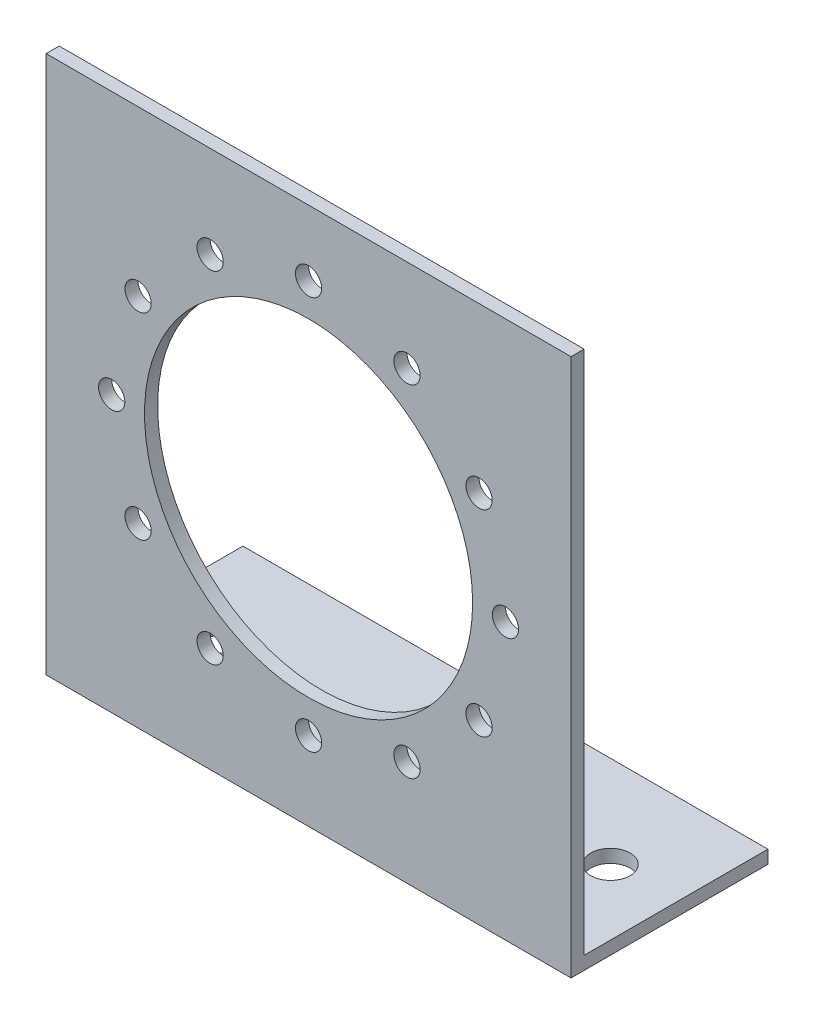
ISO-10303-21;
HEADER;
FILE_DESCRIPTION(('STEP AP214'),'2;1');
FILE_NAME('part.step','',(''),(''),'','','');
FILE_SCHEMA(('AUTOMOTIVE_DESIGN { 1 0 10303 214 1 1 1 1 }'));
ENDSEC;
DATA;
#1=APPLICATION_CONTEXT('core data for automotive mechanical design processes');
#2=APPLICATION_PROTOCOL_DEFINITION('international standard','automotive_design',2000,#1);
#3=PRODUCT_CONTEXT('',#1,'mechanical');
#4=PRODUCT('Part','Part','',(#3));
#5=PRODUCT_RELATED_PRODUCT_CATEGORY('part','',(#4));
#6=PRODUCT_DEFINITION_FORMATION('','',#4);
#7=PRODUCT_DEFINITION_CONTEXT('part definition',#1,'design');
#8=PRODUCT_DEFINITION('design','',#6,#7);
#9=PRODUCT_DEFINITION_SHAPE('','',#8);
#10=(LENGTH_UNIT() NAMED_UNIT(*) SI_UNIT(.MILLI.,.METRE.));
#11=(NAMED_UNIT(*) PLANE_ANGLE_UNIT() SI_UNIT($,.RADIAN.));
#12=(NAMED_UNIT(*) SI_UNIT($,.STERADIAN.) SOLID_ANGLE_UNIT());
#13=UNCERTAINTY_MEASURE_WITH_UNIT(LENGTH_MEASURE(1.E-05),#10,'distance_accuracy_value','');
#14=(GEOMETRIC_REPRESENTATION_CONTEXT(3) GLOBAL_UNCERTAINTY_ASSIGNED_CONTEXT((#13)) GLOBAL_UNIT_ASSIGNED_CONTEXT((#10,
#11,#12)) REPRESENTATION_CONTEXT('',''));
#15=CARTESIAN_POINT('',(0.,0.,0.));
#16=DIRECTION('',(0.,0.,1.));
#17=DIRECTION('',(1.,0.,0.));
#18=AXIS2_PLACEMENT_3D('',#15,#16,#17);
#19=CARTESIAN_POINT('',(0.,0.,1.));
#20=DIRECTION('',(0.,0.,-1.));
#21=DIRECTION('',(-1.,0.,0.));
#22=AXIS2_PLACEMENT_3D('',#19,#20,#21);
#23=PLANE('',#22);
#24=DIRECTION('',(0.,1.,0.));
#25=VECTOR('',#24,1.);
#26=CARTESIAN_POINT('',(20.,-20.,1.));
#27=LINE('',#26,#25);
#28=CARTESIAN_POINT('',(20.,-21.,1.));
#29=VERTEX_POINT('',#28);
#30=CARTESIAN_POINT('',(20.,20.,1.));
#31=VERTEX_POINT('',#30);
#32=EDGE_CURVE('E92',#29,#31,#27,.T.);
#33=ORIENTED_EDGE('',*,*,#32,.T.);
#34=DIRECTION('',(-1.,0.,0.));
#35=VECTOR('',#34,1.);
#36=CARTESIAN_POINT('',(-20.,20.,1.));
#37=LINE('',#36,#35);
#38=CARTESIAN_POINT('',(-20.,20.,1.));
#39=VERTEX_POINT('',#38);
#40=EDGE_CURVE('E54',#31,#39,#37,.T.);
#41=ORIENTED_EDGE('',*,*,#40,.T.);
#42=DIRECTION('',(0.,-1.,0.));
#43=VECTOR('',#42,1.);
#44=CARTESIAN_POINT('',(-20.,-20.,1.));
#45=LINE('',#44,#43);
#46=CARTESIAN_POINT('',(-20.,-21.,1.));
#47=VERTEX_POINT('',#46);
#48=EDGE_CURVE('E188',#39,#47,#45,.T.);
#49=ORIENTED_EDGE('',*,*,#48,.T.);
#50=DIRECTION('',(1.,0.,0.));
#51=VECTOR('',#50,1.);
#52=CARTESIAN_POINT('',(-20.,-21.,1.));
#53=LINE('',#52,#51);
#54=EDGE_CURVE('E209',#47,#29,#53,.T.);
#55=ORIENTED_EDGE('',*,*,#54,.T.);
#56=EDGE_LOOP('',(#33,#41,#49,#55));
#57=FACE_BOUND('',#56,.T.);
#58=CARTESIAN_POINT('',(0.,0.,1.));
#59=DIRECTION('',(0.,0.,1.));
#60=DIRECTION('',(1.,0.,0.));
#61=AXIS2_PLACEMENT_3D('',#58,#59,#60);
#62=CIRCLE('',#61,12.5);
#63=CARTESIAN_POINT('',(12.5,0.,1.));
#64=VERTEX_POINT('',#63);
#65=EDGE_CURVE('E181',#64,#64,#62,.T.);
#66=ORIENTED_EDGE('',*,*,#65,.F.);
#67=EDGE_LOOP('',(#66));
#68=FACE_BOUND('',#67,.T.);
#69=CARTESIAN_POINT('',(0.,15.,1.));
#70=DIRECTION('',(0.,0.,1.));
#71=DIRECTION('',(1.,0.,0.));
#72=AXIS2_PLACEMENT_3D('',#69,#70,#71);
#73=CIRCLE('',#72,1.);
#74=CARTESIAN_POINT('',(1.,15.,1.));
#75=VERTEX_POINT('',#74);
#76=EDGE_CURVE('E175',#75,#75,#73,.T.);
#77=ORIENTED_EDGE('',*,*,#76,.F.);
#78=EDGE_LOOP('',(#77));
#79=FACE_BOUND('',#78,.T.);
#80=CARTESIAN_POINT('',(7.50000000000011,12.990381056767,1.));
#81=DIRECTION('',(0.,0.,1.));
#82=DIRECTION('',(1.,0.,0.));
#83=AXIS2_PLACEMENT_3D('',#80,#81,#82);
#84=CIRCLE('',#83,1.);
#85=CARTESIAN_POINT('',(8.50000000000011,12.990381056767,1.));
#86=VERTEX_POINT('',#85);
#87=EDGE_CURVE('E169',#86,#86,#84,.T.);
#88=ORIENTED_EDGE('',*,*,#87,.F.);
#89=EDGE_LOOP('',(#88));
#90=FACE_BOUND('',#89,.T.);
#91=CARTESIAN_POINT('',(12.990381056767,7.50000000000065,1.));
#92=DIRECTION('',(0.,0.,1.));
#93=DIRECTION('',(1.,0.,0.));
#94=AXIS2_PLACEMENT_3D('',#91,#92,#93);
#95=CIRCLE('',#94,1.);
#96=CARTESIAN_POINT('',(13.990381056767,7.50000000000065,1.));
#97=VERTEX_POINT('',#96);
#98=EDGE_CURVE('E163',#97,#97,#95,.T.);
#99=ORIENTED_EDGE('',*,*,#98,.F.);
#100=EDGE_LOOP('',(#99));
#101=FACE_BOUND('',#100,.T.);
#102=CARTESIAN_POINT('',(15.0000000000007,7.43773659799704E-13,1.));
#103=DIRECTION('',(0.,0.,1.));
#104=DIRECTION('',(1.,0.,0.));
#105=AXIS2_PLACEMENT_3D('',#102,#103,#104);
#106=CIRCLE('',#105,1.);
#107=CARTESIAN_POINT('',(16.0000000000007,7.43773659799704E-13,1.));
#108=VERTEX_POINT('',#107);
#109=EDGE_CURVE('E157',#108,#108,#106,.T.);
#110=ORIENTED_EDGE('',*,*,#109,.F.);
#111=EDGE_LOOP('',(#110));
#112=FACE_BOUND('',#111,.T.);
#113=CARTESIAN_POINT('',(12.9903810567677,-7.49999999999936,1.));
#114=DIRECTION('',(0.,0.,1.));
#115=DIRECTION('',(1.,0.,0.));
#116=AXIS2_PLACEMENT_3D('',#113,#114,#115);
#117=CIRCLE('',#116,1.);
#118=CARTESIAN_POINT('',(13.9903810567677,-7.49999999999936,1.));
#119=VERTEX_POINT('',#118);
#120=EDGE_CURVE('E151',#119,#119,#117,.T.);
#121=ORIENTED_EDGE('',*,*,#120,.F.);
#122=EDGE_LOOP('',(#121));
#123=FACE_BOUND('',#122,.T.);
#124=CARTESIAN_POINT('',(7.50000000000139,-12.9903810567662,1.));
#125=DIRECTION('',(0.,0.,1.));
#126=DIRECTION('',(1.,0.,0.));
#127=AXIS2_PLACEMENT_3D('',#124,#125,#126);
#128=CIRCLE('',#127,0.999999999999999);
#129=CARTESIAN_POINT('',(8.50000000000139,-12.9903810567662,1.));
#130=VERTEX_POINT('',#129);
#131=EDGE_CURVE('E145',#130,#130,#128,.T.);
#132=ORIENTED_EDGE('',*,*,#131,.F.);
#133=EDGE_LOOP('',(#132));
#134=FACE_BOUND('',#133,.T.);
#135=CARTESIAN_POINT('',(1.48754731959941E-12,-15.,1.));
#136=DIRECTION('',(0.,0.,1.));
#137=DIRECTION('',(1.,0.,0.));
#138=AXIS2_PLACEMENT_3D('',#135,#136,#137);
#139=CIRCLE('',#138,1.);
#140=CARTESIAN_POINT('',(1.00000000000149,-15.,1.));
#141=VERTEX_POINT('',#140);
#142=EDGE_CURVE('E139',#141,#141,#139,.T.);
#143=ORIENTED_EDGE('',*,*,#142,.F.);
#144=EDGE_LOOP('',(#143));
#145=FACE_BOUND('',#144,.T.);
#146=CARTESIAN_POINT('',(-7.49999999999861,-12.990381056767,1.));
#147=DIRECTION('',(0.,0.,1.));
#148=DIRECTION('',(1.,0.,0.));
#149=AXIS2_PLACEMENT_3D('',#146,#147,#148);
#150=CIRCLE('',#149,1.);
#151=CARTESIAN_POINT('',(-6.49999999999861,-12.990381056767,1.));
#152=VERTEX_POINT('',#151);
#153=EDGE_CURVE('E133',#152,#152,#150,.T.);
#154=ORIENTED_EDGE('',*,*,#153,.F.);
#155=EDGE_LOOP('',(#154));
#156=FACE_BOUND('',#155,.T.);
#157=CARTESIAN_POINT('',(-12.9903810567655,-7.50000000000065,1.));
#158=DIRECTION('',(0.,0.,1.));
#159=DIRECTION('',(1.,0.,0.));
#160=AXIS2_PLACEMENT_3D('',#157,#158,#159);
#161=CIRCLE('',#160,1.);
#162=CARTESIAN_POINT('',(-11.9903810567655,-7.50000000000065,1.));
#163=VERTEX_POINT('',#162);
#164=EDGE_CURVE('E127',#163,#163,#161,.T.);
#165=ORIENTED_EDGE('',*,*,#164,.F.);
#166=EDGE_LOOP('',(#165));
#167=FACE_BOUND('',#166,.T.);
#168=CARTESIAN_POINT('',(-14.9999999999993,-7.45610629998425E-13,1.));
#169=DIRECTION('',(0.,0.,1.));
#170=DIRECTION('',(1.,0.,0.));
#171=AXIS2_PLACEMENT_3D('',#168,#169,#170);
#172=CIRCLE('',#171,1.);
#173=CARTESIAN_POINT('',(-13.9999999999993,-7.45610629998425E-13,1.));
#174=VERTEX_POINT('',#173);
#175=EDGE_CURVE('E121',#174,#174,#172,.T.);
#176=ORIENTED_EDGE('',*,*,#175,.F.);
#177=EDGE_LOOP('',(#176));
#178=FACE_BOUND('',#177,.T.);
#179=CARTESIAN_POINT('',(-12.9903810567662,7.49999999999935,1.));
#180=DIRECTION('',(0.,0.,1.));
#181=DIRECTION('',(1.,0.,0.));
#182=AXIS2_PLACEMENT_3D('',#179,#180,#181);
#183=CIRCLE('',#182,1.);
#184=CARTESIAN_POINT('',(-11.9903810567662,7.49999999999935,1.));
#185=VERTEX_POINT('',#184);
#186=EDGE_CURVE('E115',#185,#185,#183,.T.);
#187=ORIENTED_EDGE('',*,*,#186,.F.);
#188=EDGE_LOOP('',(#187));
#189=FACE_BOUND('',#188,.T.);
#190=CARTESIAN_POINT('',(-7.49999999999991,12.9903810567662,1.));
#191=DIRECTION('',(0.,0.,1.));
#192=DIRECTION('',(1.,0.,0.));
#193=AXIS2_PLACEMENT_3D('',#190,#191,#192);
#194=CIRCLE('',#193,1.);
#195=CARTESIAN_POINT('',(-6.49999999999991,12.9903810567662,1.));
#196=VERTEX_POINT('',#195);
#197=EDGE_CURVE('E108',#196,#196,#194,.T.);
#198=ORIENTED_EDGE('',*,*,#197,.F.);
#199=EDGE_LOOP('',(#198));
#200=FACE_BOUND('',#199,.T.);
#201=ADVANCED_FACE('F37',(#57,#68,#79,#90,#101,#112,#123,#134,#145,#156,#167,#178,#189,#200),
#23,.F.);
#202=CARTESIAN_POINT('',(0.,0.,0.));
#203=DIRECTION('',(0.,0.,-1.));
#204=DIRECTION('',(-1.,0.,0.));
#205=AXIS2_PLACEMENT_3D('',#202,#203,#204);
#206=PLANE('',#205);
#207=CARTESIAN_POINT('',(-12.9903810567662,7.49999999999935,0.));
#208=DIRECTION('',(0.,0.,1.));
#209=DIRECTION('',(1.,0.,0.));
#210=AXIS2_PLACEMENT_3D('',#207,#208,#209);
#211=CIRCLE('',#210,1.);
#212=CARTESIAN_POINT('',(-11.9903810567662,7.49999999999935,0.));
#213=VERTEX_POINT('',#212);
#214=EDGE_CURVE('E111',#213,#213,#211,.T.);
#215=ORIENTED_EDGE('',*,*,#214,.T.);
#216=EDGE_LOOP('',(#215));
#217=FACE_BOUND('',#216,.T.);
#218=CARTESIAN_POINT('',(-12.9903810567655,-7.50000000000065,0.));
#219=DIRECTION('',(0.,0.,1.));
#220=DIRECTION('',(1.,0.,0.));
#221=AXIS2_PLACEMENT_3D('',#218,#219,#220);
#222=CIRCLE('',#221,1.);
#223=CARTESIAN_POINT('',(-11.9903810567655,-7.50000000000065,0.));
#224=VERTEX_POINT('',#223);
#225=EDGE_CURVE('E124',#224,#224,#222,.T.);
#226=ORIENTED_EDGE('',*,*,#225,.T.);
#227=EDGE_LOOP('',(#226));
#228=FACE_BOUND('',#227,.T.);
#229=CARTESIAN_POINT('',(1.48754731959941E-12,-15.,0.));
#230=DIRECTION('',(0.,0.,1.));
#231=DIRECTION('',(1.,0.,0.));
#232=AXIS2_PLACEMENT_3D('',#229,#230,#231);
#233=CIRCLE('',#232,1.);
#234=CARTESIAN_POINT('',(1.00000000000149,-15.,0.));
#235=VERTEX_POINT('',#234);
#236=EDGE_CURVE('E136',#235,#235,#233,.T.);
#237=ORIENTED_EDGE('',*,*,#236,.T.);
#238=EDGE_LOOP('',(#237));
#239=FACE_BOUND('',#238,.T.);
#240=CARTESIAN_POINT('',(12.9903810567677,-7.49999999999936,0.));
#241=DIRECTION('',(0.,0.,1.));
#242=DIRECTION('',(1.,0.,0.));
#243=AXIS2_PLACEMENT_3D('',#240,#241,#242);
#244=CIRCLE('',#243,1.);
#245=CARTESIAN_POINT('',(13.9903810567677,-7.49999999999936,0.));
#246=VERTEX_POINT('',#245);
#247=EDGE_CURVE('E148',#246,#246,#244,.T.);
#248=ORIENTED_EDGE('',*,*,#247,.T.);
#249=EDGE_LOOP('',(#248));
#250=FACE_BOUND('',#249,.T.);
#251=CARTESIAN_POINT('',(12.990381056767,7.50000000000065,0.));
#252=DIRECTION('',(0.,0.,1.));
#253=DIRECTION('',(1.,0.,0.));
#254=AXIS2_PLACEMENT_3D('',#251,#252,#253);
#255=CIRCLE('',#254,1.);
#256=CARTESIAN_POINT('',(13.990381056767,7.50000000000065,0.));
#257=VERTEX_POINT('',#256);
#258=EDGE_CURVE('E160',#257,#257,#255,.T.);
#259=ORIENTED_EDGE('',*,*,#258,.T.);
#260=EDGE_LOOP('',(#259));
#261=FACE_BOUND('',#260,.T.);
#262=CARTESIAN_POINT('',(0.,15.,0.));
#263=DIRECTION('',(0.,0.,1.));
#264=DIRECTION('',(1.,0.,0.));
#265=AXIS2_PLACEMENT_3D('',#262,#263,#264);
#266=CIRCLE('',#265,1.);
#267=CARTESIAN_POINT('',(1.,15.,0.));
#268=VERTEX_POINT('',#267);
#269=EDGE_CURVE('E172',#268,#268,#266,.T.);
#270=ORIENTED_EDGE('',*,*,#269,.T.);
#271=EDGE_LOOP('',(#270));
#272=FACE_BOUND('',#271,.T.);
#273=DIRECTION('',(0.,1.,0.));
#274=VECTOR('',#273,1.);
#275=CARTESIAN_POINT('',(20.,-20.,0.));
#276=LINE('',#275,#274);
#277=CARTESIAN_POINT('',(20.,-20.,0.));
#278=VERTEX_POINT('',#277);
#279=CARTESIAN_POINT('',(20.,20.,0.));
#280=VERTEX_POINT('',#279);
#281=EDGE_CURVE('E88',#278,#280,#276,.T.);
#282=ORIENTED_EDGE('',*,*,#281,.F.);
#283=DIRECTION('',(1.,0.,0.));
#284=VECTOR('',#283,1.);
#285=CARTESIAN_POINT('',(-20.,-20.,0.));
#286=LINE('',#285,#284);
#287=CARTESIAN_POINT('',(-20.,-20.,0.));
#288=VERTEX_POINT('',#287);
#289=EDGE_CURVE('E81',#288,#278,#286,.T.);
#290=ORIENTED_EDGE('',*,*,#289,.F.);
#291=DIRECTION('',(0.,-1.,0.));
#292=VECTOR('',#291,1.);
#293=CARTESIAN_POINT('',(-20.,-20.,0.));
#294=LINE('',#293,#292);
#295=CARTESIAN_POINT('',(-20.,20.,0.));
#296=VERTEX_POINT('',#295);
#297=EDGE_CURVE('E71',#296,#288,#294,.T.);
#298=ORIENTED_EDGE('',*,*,#297,.F.);
#299=DIRECTION('',(-1.,0.,0.));
#300=VECTOR('',#299,1.);
#301=CARTESIAN_POINT('',(-20.,20.,0.));
#302=LINE('',#301,#300);
#303=EDGE_CURVE('E65',#280,#296,#302,.T.);
#304=ORIENTED_EDGE('',*,*,#303,.F.);
#305=EDGE_LOOP('',(#282,#290,#298,#304));
#306=FACE_BOUND('',#305,.T.);
#307=CARTESIAN_POINT('',(0.,0.,0.));
#308=DIRECTION('',(0.,0.,1.));
#309=DIRECTION('',(1.,0.,0.));
#310=AXIS2_PLACEMENT_3D('',#307,#308,#309);
#311=CIRCLE('',#310,12.5);
#312=CARTESIAN_POINT('',(12.5,0.,0.));
#313=VERTEX_POINT('',#312);
#314=EDGE_CURVE('E178',#313,#313,#311,.T.);
#315=ORIENTED_EDGE('',*,*,#314,.T.);
#316=EDGE_LOOP('',(#315));
#317=FACE_BOUND('',#316,.T.);
#318=CARTESIAN_POINT('',(7.50000000000011,12.990381056767,0.));
#319=DIRECTION('',(0.,0.,1.));
#320=DIRECTION('',(1.,0.,0.));
#321=AXIS2_PLACEMENT_3D('',#318,#319,#320);
#322=CIRCLE('',#321,1.);
#323=CARTESIAN_POINT('',(8.50000000000011,12.990381056767,0.));
#324=VERTEX_POINT('',#323);
#325=EDGE_CURVE('E166',#324,#324,#322,.T.);
#326=ORIENTED_EDGE('',*,*,#325,.T.);
#327=EDGE_LOOP('',(#326));
#328=FACE_BOUND('',#327,.T.);
#329=CARTESIAN_POINT('',(15.0000000000007,7.43773659799704E-13,0.));
#330=DIRECTION('',(0.,0.,1.));
#331=DIRECTION('',(1.,0.,0.));
#332=AXIS2_PLACEMENT_3D('',#329,#330,#331);
#333=CIRCLE('',#332,1.);
#334=CARTESIAN_POINT('',(16.0000000000007,7.43773659799704E-13,0.));
#335=VERTEX_POINT('',#334);
#336=EDGE_CURVE('E154',#335,#335,#333,.T.);
#337=ORIENTED_EDGE('',*,*,#336,.T.);
#338=EDGE_LOOP('',(#337));
#339=FACE_BOUND('',#338,.T.);
#340=CARTESIAN_POINT('',(7.50000000000139,-12.9903810567662,0.));
#341=DIRECTION('',(0.,0.,1.));
#342=DIRECTION('',(1.,0.,0.));
#343=AXIS2_PLACEMENT_3D('',#340,#341,#342);
#344=CIRCLE('',#343,0.999999999999999);
#345=CARTESIAN_POINT('',(8.50000000000139,-12.9903810567662,0.));
#346=VERTEX_POINT('',#345);
#347=EDGE_CURVE('E142',#346,#346,#344,.T.);
#348=ORIENTED_EDGE('',*,*,#347,.T.);
#349=EDGE_LOOP('',(#348));
#350=FACE_BOUND('',#349,.T.);
#351=CARTESIAN_POINT('',(-7.49999999999861,-12.990381056767,0.));
#352=DIRECTION('',(0.,0.,1.));
#353=DIRECTION('',(1.,0.,0.));
#354=AXIS2_PLACEMENT_3D('',#351,#352,#353);
#355=CIRCLE('',#354,1.);
#356=CARTESIAN_POINT('',(-6.49999999999861,-12.990381056767,0.));
#357=VERTEX_POINT('',#356);
#358=EDGE_CURVE('E130',#357,#357,#355,.T.);
#359=ORIENTED_EDGE('',*,*,#358,.T.);
#360=EDGE_LOOP('',(#359));
#361=FACE_BOUND('',#360,.T.);
#362=CARTESIAN_POINT('',(-14.9999999999993,-7.45610629998425E-13,0.));
#363=DIRECTION('',(0.,0.,1.));
#364=DIRECTION('',(1.,0.,0.));
#365=AXIS2_PLACEMENT_3D('',#362,#363,#364);
#366=CIRCLE('',#365,1.);
#367=CARTESIAN_POINT('',(-13.9999999999993,-7.45610629998425E-13,0.));
#368=VERTEX_POINT('',#367);
#369=EDGE_CURVE('E118',#368,#368,#366,.T.);
#370=ORIENTED_EDGE('',*,*,#369,.T.);
#371=EDGE_LOOP('',(#370));
#372=FACE_BOUND('',#371,.T.);
#373=CARTESIAN_POINT('',(-7.49999999999991,12.9903810567662,0.));
#374=DIRECTION('',(0.,0.,1.));
#375=DIRECTION('',(1.,0.,0.));
#376=AXIS2_PLACEMENT_3D('',#373,#374,#375);
#377=CIRCLE('',#376,1.);
#378=CARTESIAN_POINT('',(-6.49999999999991,12.9903810567662,0.));
#379=VERTEX_POINT('',#378);
#380=EDGE_CURVE('E112',#379,#379,#377,.T.);
#381=ORIENTED_EDGE('',*,*,#380,.T.);
#382=EDGE_LOOP('',(#381));
#383=FACE_BOUND('',#382,.T.);
#384=ADVANCED_FACE('F85',(#217,#228,#239,#250,#261,#272,#306,#317,#328,#339,#350,#361,#372,
#383),#206,.T.);
#385=CARTESIAN_POINT('',(20.,-20.,1.));
#386=DIRECTION('',(-1.,0.,0.));
#387=DIRECTION('',(0.,0.,1.));
#388=AXIS2_PLACEMENT_3D('',#385,#386,#387);
#389=PLANE('',#388);
#390=ORIENTED_EDGE('',*,*,#281,.T.);
#391=DIRECTION('',(0.,0.,-1.));
#392=VECTOR('',#391,1.);
#393=CARTESIAN_POINT('',(20.,20.,1.));
#394=LINE('',#393,#392);
#395=EDGE_CURVE('E11',#31,#280,#394,.T.);
#396=ORIENTED_EDGE('',*,*,#395,.F.);
#397=ORIENTED_EDGE('',*,*,#32,.F.);
#398=DIRECTION('',(0.,0.,1.));
#399=VECTOR('',#398,1.);
#400=CARTESIAN_POINT('',(20.,-21.,-14.));
#401=LINE('',#400,#399);
#402=CARTESIAN_POINT('',(20.,-21.,-14.));
#403=VERTEX_POINT('',#402);
#404=EDGE_CURVE('E102',#403,#29,#401,.T.);
#405=ORIENTED_EDGE('',*,*,#404,.F.);
#406=DIRECTION('',(0.,1.,0.));
#407=VECTOR('',#406,1.);
#408=CARTESIAN_POINT('',(20.,-20.,-14.));
#409=LINE('',#408,#407);
#410=CARTESIAN_POINT('',(20.,-20.,-14.));
#411=VERTEX_POINT('',#410);
#412=EDGE_CURVE('E198',#403,#411,#409,.T.);
#413=ORIENTED_EDGE('',*,*,#412,.T.);
#414=DIRECTION('',(0.,0.,1.));
#415=VECTOR('',#414,1.);
#416=CARTESIAN_POINT('',(20.,-20.,-14.));
#417=LINE('',#416,#415);
#418=EDGE_CURVE('E99',#411,#278,#417,.T.);
#419=ORIENTED_EDGE('',*,*,#418,.T.);
#420=EDGE_LOOP('',(#390,#396,#397,#405,#413,#419));
#421=FACE_BOUND('',#420,.T.);
#422=ADVANCED_FACE('F39',(#421),#389,.F.);
#423=CARTESIAN_POINT('',(-20.,20.,1.));
#424=DIRECTION('',(0.,-1.,0.));
#425=DIRECTION('',(0.,0.,-1.));
#426=AXIS2_PLACEMENT_3D('',#423,#424,#425);
#427=PLANE('',#426);
#428=ORIENTED_EDGE('',*,*,#303,.T.);
#429=DIRECTION('',(0.,0.,-1.));
#430=VECTOR('',#429,1.);
#431=CARTESIAN_POINT('',(-20.,20.,1.));
#432=LINE('',#431,#430);
#433=EDGE_CURVE('E46',#39,#296,#432,.T.);
#434=ORIENTED_EDGE('',*,*,#433,.F.);
#435=ORIENTED_EDGE('',*,*,#40,.F.);
#436=ORIENTED_EDGE('',*,*,#395,.T.);
#437=EDGE_LOOP('',(#428,#434,#435,#436));
#438=FACE_BOUND('',#437,.T.);
#439=ADVANCED_FACE('F270',(#438),#427,.F.);
#440=CARTESIAN_POINT('',(-20.,-20.,1.));
#441=DIRECTION('',(1.,0.,0.));
#442=DIRECTION('',(0.,0.,-1.));
#443=AXIS2_PLACEMENT_3D('',#440,#441,#442);
#444=PLANE('',#443);
#445=ORIENTED_EDGE('',*,*,#297,.T.);
#446=DIRECTION('',(0.,0.,1.));
#447=VECTOR('',#446,1.);
#448=CARTESIAN_POINT('',(-20.,-20.,-14.));
#449=LINE('',#448,#447);
#450=CARTESIAN_POINT('',(-20.,-20.,-14.));
#451=VERTEX_POINT('',#450);
#452=EDGE_CURVE('E77',#451,#288,#449,.T.);
#453=ORIENTED_EDGE('',*,*,#452,.F.);
#454=DIRECTION('',(0.,-1.,0.));
#455=VECTOR('',#454,1.);
#456=CARTESIAN_POINT('',(-20.,-20.,-14.));
#457=LINE('',#456,#455);
#458=CARTESIAN_POINT('',(-20.,-21.,-14.));
#459=VERTEX_POINT('',#458);
#460=EDGE_CURVE('E206',#451,#459,#457,.T.);
#461=ORIENTED_EDGE('',*,*,#460,.T.);
#462=DIRECTION('',(0.,0.,1.));
#463=VECTOR('',#462,1.);
#464=CARTESIAN_POINT('',(-20.,-21.,-14.));
#465=LINE('',#464,#463);
#466=EDGE_CURVE('E98',#459,#47,#465,.T.);
#467=ORIENTED_EDGE('',*,*,#466,.T.);
#468=ORIENTED_EDGE('',*,*,#48,.F.);
#469=ORIENTED_EDGE('',*,*,#433,.T.);
#470=EDGE_LOOP('',(#445,#453,#461,#467,#468,#469));
#471=FACE_BOUND('',#470,.T.);
#472=ADVANCED_FACE('F73',(#471),#444,.F.);
#473=CARTESIAN_POINT('',(0.,0.,1.));
#474=DIRECTION('',(0.,0.,-1.));
#475=DIRECTION('',(-1.,0.,0.));
#476=AXIS2_PLACEMENT_3D('',#473,#474,#475);
#477=CYLINDRICAL_SURFACE('',#476,12.5);
#478=ORIENTED_EDGE('',*,*,#65,.T.);
#479=EDGE_LOOP('',(#478));
#480=FACE_BOUND('',#479,.T.);
#481=ORIENTED_EDGE('',*,*,#314,.F.);
#482=EDGE_LOOP('',(#481));
#483=FACE_BOUND('',#482,.T.);
#484=ADVANCED_FACE('F275',(#480,#483),#477,.F.);
#485=CARTESIAN_POINT('',(0.,15.,1.));
#486=DIRECTION('',(0.,0.,-1.));
#487=DIRECTION('',(-1.,0.,0.));
#488=AXIS2_PLACEMENT_3D('',#485,#486,#487);
#489=CYLINDRICAL_SURFACE('',#488,1.);
#490=ORIENTED_EDGE('',*,*,#76,.T.);
#491=EDGE_LOOP('',(#490));
#492=FACE_BOUND('',#491,.T.);
#493=ORIENTED_EDGE('',*,*,#269,.F.);
#494=EDGE_LOOP('',(#493));
#495=FACE_BOUND('',#494,.T.);
#496=ADVANCED_FACE('F292',(#492,#495),#489,.F.);
#497=CARTESIAN_POINT('',(7.50000000000011,12.990381056767,1.));
#498=DIRECTION('',(0.,0.,-1.));
#499=DIRECTION('',(-1.,0.,0.));
#500=AXIS2_PLACEMENT_3D('',#497,#498,#499);
#501=CYLINDRICAL_SURFACE('',#500,1.);
#502=ORIENTED_EDGE('',*,*,#87,.T.);
#503=EDGE_LOOP('',(#502));
#504=FACE_BOUND('',#503,.T.);
#505=ORIENTED_EDGE('',*,*,#325,.F.);
#506=EDGE_LOOP('',(#505));
#507=FACE_BOUND('',#506,.T.);
#508=ADVANCED_FACE('F299',(#504,#507),#501,.F.);
#509=CARTESIAN_POINT('',(12.990381056767,7.50000000000065,1.));
#510=DIRECTION('',(0.,0.,-1.));
#511=DIRECTION('',(-1.,0.,0.));
#512=AXIS2_PLACEMENT_3D('',#509,#510,#511);
#513=CYLINDRICAL_SURFACE('',#512,1.);
#514=ORIENTED_EDGE('',*,*,#98,.T.);
#515=EDGE_LOOP('',(#514));
#516=FACE_BOUND('',#515,.T.);
#517=ORIENTED_EDGE('',*,*,#258,.F.);
#518=EDGE_LOOP('',(#517));
#519=FACE_BOUND('',#518,.T.);
#520=ADVANCED_FACE('F307',(#516,#519),#513,.F.);
#521=CARTESIAN_POINT('',(15.0000000000007,7.43773659799704E-13,1.));
#522=DIRECTION('',(0.,0.,-1.));
#523=DIRECTION('',(-1.,0.,0.));
#524=AXIS2_PLACEMENT_3D('',#521,#522,#523);
#525=CYLINDRICAL_SURFACE('',#524,1.);
#526=ORIENTED_EDGE('',*,*,#109,.T.);
#527=EDGE_LOOP('',(#526));
#528=FACE_BOUND('',#527,.T.);
#529=ORIENTED_EDGE('',*,*,#336,.F.);
#530=EDGE_LOOP('',(#529));
#531=FACE_BOUND('',#530,.T.);
#532=ADVANCED_FACE('F315',(#528,#531),#525,.F.);
#533=CARTESIAN_POINT('',(12.9903810567677,-7.49999999999936,1.));
#534=DIRECTION('',(0.,0.,-1.));
#535=DIRECTION('',(-1.,0.,0.));
#536=AXIS2_PLACEMENT_3D('',#533,#534,#535);
#537=CYLINDRICAL_SURFACE('',#536,1.);
#538=ORIENTED_EDGE('',*,*,#120,.T.);
#539=EDGE_LOOP('',(#538));
#540=FACE_BOUND('',#539,.T.);
#541=ORIENTED_EDGE('',*,*,#247,.F.);
#542=EDGE_LOOP('',(#541));
#543=FACE_BOUND('',#542,.T.);
#544=ADVANCED_FACE('F323',(#540,#543),#537,.F.);
#545=CARTESIAN_POINT('',(7.50000000000139,-12.9903810567662,1.));
#546=DIRECTION('',(0.,0.,-1.));
#547=DIRECTION('',(-1.,0.,0.));
#548=AXIS2_PLACEMENT_3D('',#545,#546,#547);
#549=CYLINDRICAL_SURFACE('',#548,0.999999999999999);
#550=ORIENTED_EDGE('',*,*,#131,.T.);
#551=EDGE_LOOP('',(#550));
#552=FACE_BOUND('',#551,.T.);
#553=ORIENTED_EDGE('',*,*,#347,.F.);
#554=EDGE_LOOP('',(#553));
#555=FACE_BOUND('',#554,.T.);
#556=ADVANCED_FACE('F331',(#552,#555),#549,.F.);
#557=CARTESIAN_POINT('',(1.48754731959941E-12,-15.,1.));
#558=DIRECTION('',(0.,0.,-1.));
#559=DIRECTION('',(-1.,0.,0.));
#560=AXIS2_PLACEMENT_3D('',#557,#558,#559);
#561=CYLINDRICAL_SURFACE('',#560,1.);
#562=ORIENTED_EDGE('',*,*,#142,.T.);
#563=EDGE_LOOP('',(#562));
#564=FACE_BOUND('',#563,.T.);
#565=ORIENTED_EDGE('',*,*,#236,.F.);
#566=EDGE_LOOP('',(#565));
#567=FACE_BOUND('',#566,.T.);
#568=ADVANCED_FACE('F339',(#564,#567),#561,.F.);
#569=CARTESIAN_POINT('',(-7.49999999999861,-12.990381056767,1.));
#570=DIRECTION('',(0.,0.,-1.));
#571=DIRECTION('',(-1.,0.,0.));
#572=AXIS2_PLACEMENT_3D('',#569,#570,#571);
#573=CYLINDRICAL_SURFACE('',#572,1.);
#574=ORIENTED_EDGE('',*,*,#153,.T.);
#575=EDGE_LOOP('',(#574));
#576=FACE_BOUND('',#575,.T.);
#577=ORIENTED_EDGE('',*,*,#358,.F.);
#578=EDGE_LOOP('',(#577));
#579=FACE_BOUND('',#578,.T.);
#580=ADVANCED_FACE('F347',(#576,#579),#573,.F.);
#581=CARTESIAN_POINT('',(-12.9903810567655,-7.50000000000065,1.));
#582=DIRECTION('',(0.,0.,-1.));
#583=DIRECTION('',(-1.,0.,0.));
#584=AXIS2_PLACEMENT_3D('',#581,#582,#583);
#585=CYLINDRICAL_SURFACE('',#584,1.);
#586=ORIENTED_EDGE('',*,*,#164,.T.);
#587=EDGE_LOOP('',(#586));
#588=FACE_BOUND('',#587,.T.);
#589=ORIENTED_EDGE('',*,*,#225,.F.);
#590=EDGE_LOOP('',(#589));
#591=FACE_BOUND('',#590,.T.);
#592=ADVANCED_FACE('F355',(#588,#591),#585,.F.);
#593=CARTESIAN_POINT('',(-14.9999999999993,-7.45610629998425E-13,1.));
#594=DIRECTION('',(0.,0.,-1.));
#595=DIRECTION('',(-1.,0.,0.));
#596=AXIS2_PLACEMENT_3D('',#593,#594,#595);
#597=CYLINDRICAL_SURFACE('',#596,1.);
#598=ORIENTED_EDGE('',*,*,#175,.T.);
#599=EDGE_LOOP('',(#598));
#600=FACE_BOUND('',#599,.T.);
#601=ORIENTED_EDGE('',*,*,#369,.F.);
#602=EDGE_LOOP('',(#601));
#603=FACE_BOUND('',#602,.T.);
#604=ADVANCED_FACE('F363',(#600,#603),#597,.F.);
#605=CARTESIAN_POINT('',(-12.9903810567662,7.49999999999935,1.));
#606=DIRECTION('',(0.,0.,-1.));
#607=DIRECTION('',(-1.,0.,0.));
#608=AXIS2_PLACEMENT_3D('',#605,#606,#607);
#609=CYLINDRICAL_SURFACE('',#608,1.);
#610=ORIENTED_EDGE('',*,*,#186,.T.);
#611=EDGE_LOOP('',(#610));
#612=FACE_BOUND('',#611,.T.);
#613=ORIENTED_EDGE('',*,*,#214,.F.);
#614=EDGE_LOOP('',(#613));
#615=FACE_BOUND('',#614,.T.);
#616=ADVANCED_FACE('F260',(#612,#615),#609,.F.);
#617=CARTESIAN_POINT('',(-7.49999999999991,12.9903810567662,1.));
#618=DIRECTION('',(0.,0.,-1.));
#619=DIRECTION('',(-1.,0.,0.));
#620=AXIS2_PLACEMENT_3D('',#617,#618,#619);
#621=CYLINDRICAL_SURFACE('',#620,1.);
#622=ORIENTED_EDGE('',*,*,#197,.T.);
#623=EDGE_LOOP('',(#622));
#624=FACE_BOUND('',#623,.T.);
#625=ORIENTED_EDGE('',*,*,#380,.F.);
#626=EDGE_LOOP('',(#625));
#627=FACE_BOUND('',#626,.T.);
#628=ADVANCED_FACE('F257',(#624,#627),#621,.F.);
#629=CARTESIAN_POINT('',(-20.,-21.,-14.));
#630=DIRECTION('',(0.,-1.,0.));
#631=DIRECTION('',(0.,0.,-1.));
#632=AXIS2_PLACEMENT_3D('',#629,#630,#631);
#633=PLANE('',#632);
#634=CARTESIAN_POINT('',(-15.,-21.,-7.));
#635=DIRECTION('',(0.,1.,0.));
#636=DIRECTION('',(0.,0.,1.));
#637=AXIS2_PLACEMENT_3D('',#634,#635,#636);
#638=CIRCLE('',#637,1.5);
#639=CARTESIAN_POINT('',(-15.,-21.,-5.5));
#640=VERTEX_POINT('',#639);
#641=EDGE_CURVE('E215',#640,#640,#638,.T.);
#642=ORIENTED_EDGE('',*,*,#641,.T.);
#643=EDGE_LOOP('',(#642));
#644=FACE_BOUND('',#643,.T.);
#645=CARTESIAN_POINT('',(15.,-21.,-6.99999999999999));
#646=DIRECTION('',(0.,1.,0.));
#647=DIRECTION('',(0.,0.,-1.));
#648=AXIS2_PLACEMENT_3D('',#645,#646,#647);
#649=CIRCLE('',#648,1.5);
#650=CARTESIAN_POINT('',(15.,-21.,-8.49999999999999));
#651=VERTEX_POINT('',#650);
#652=EDGE_CURVE('E489',#651,#651,#649,.T.);
#653=ORIENTED_EDGE('',*,*,#652,.T.);
#654=EDGE_LOOP('',(#653));
#655=FACE_BOUND('',#654,.T.);
#656=ORIENTED_EDGE('',*,*,#54,.F.);
#657=ORIENTED_EDGE('',*,*,#466,.F.);
#658=DIRECTION('',(1.,0.,0.));
#659=VECTOR('',#658,1.);
#660=CARTESIAN_POINT('',(-20.,-21.,-14.));
#661=LINE('',#660,#659);
#662=EDGE_CURVE('E104',#459,#403,#661,.T.);
#663=ORIENTED_EDGE('',*,*,#662,.T.);
#664=ORIENTED_EDGE('',*,*,#404,.T.);
#665=EDGE_LOOP('',(#656,#657,#663,#664));
#666=FACE_BOUND('',#665,.T.);
#667=ADVANCED_FACE('F219',(#644,#655,#666),#633,.T.);
#668=CARTESIAN_POINT('',(-20.,-20.,-14.));
#669=DIRECTION('',(0.,1.,0.));
#670=DIRECTION('',(0.,0.,1.));
#671=AXIS2_PLACEMENT_3D('',#668,#669,#670);
#672=PLANE('',#671);
#673=CARTESIAN_POINT('',(-15.,-20.,-7.));
#674=DIRECTION('',(0.,1.,0.));
#675=DIRECTION('',(0.,0.,1.));
#676=AXIS2_PLACEMENT_3D('',#673,#674,#675);
#677=CIRCLE('',#676,1.5);
#678=CARTESIAN_POINT('',(-15.,-20.,-5.5));
#679=VERTEX_POINT('',#678);
#680=EDGE_CURVE('E488',#679,#679,#677,.T.);
#681=ORIENTED_EDGE('',*,*,#680,.F.);
#682=EDGE_LOOP('',(#681));
#683=FACE_BOUND('',#682,.T.);
#684=CARTESIAN_POINT('',(15.,-20.,-6.99999999999999));
#685=DIRECTION('',(0.,1.,0.));
#686=DIRECTION('',(0.,0.,-1.));
#687=AXIS2_PLACEMENT_3D('',#684,#685,#686);
#688=CIRCLE('',#687,1.5);
#689=CARTESIAN_POINT('',(15.,-20.,-8.49999999999999));
#690=VERTEX_POINT('',#689);
#691=EDGE_CURVE('E493',#690,#690,#688,.T.);
#692=ORIENTED_EDGE('',*,*,#691,.F.);
#693=EDGE_LOOP('',(#692));
#694=FACE_BOUND('',#693,.T.);
#695=ORIENTED_EDGE('',*,*,#452,.T.);
#696=ORIENTED_EDGE('',*,*,#289,.T.);
#697=ORIENTED_EDGE('',*,*,#418,.F.);
#698=DIRECTION('',(-1.,0.,0.));
#699=VECTOR('',#698,1.);
#700=CARTESIAN_POINT('',(-20.,-20.,-14.));
#701=LINE('',#700,#699);
#702=EDGE_CURVE('E97',#411,#451,#701,.T.);
#703=ORIENTED_EDGE('',*,*,#702,.T.);
#704=EDGE_LOOP('',(#695,#696,#697,#703));
#705=FACE_BOUND('',#704,.T.);
#706=ADVANCED_FACE('F95',(#683,#694,#705),#672,.T.);
#707=CARTESIAN_POINT('',(0.,0.,-14.));
#708=DIRECTION('',(0.,0.,1.));
#709=DIRECTION('',(1.,0.,0.));
#710=AXIS2_PLACEMENT_3D('',#707,#708,#709);
#711=PLANE('',#710);
#712=ORIENTED_EDGE('',*,*,#412,.F.);
#713=ORIENTED_EDGE('',*,*,#662,.F.);
#714=ORIENTED_EDGE('',*,*,#460,.F.);
#715=ORIENTED_EDGE('',*,*,#702,.F.);
#716=EDGE_LOOP('',(#712,#713,#714,#715));
#717=FACE_BOUND('',#716,.T.);
#718=ADVANCED_FACE('F203',(#717),#711,.F.);
#719=CARTESIAN_POINT('',(15.,-21.,-6.99999999999999));
#720=DIRECTION('',(0.,1.,0.));
#721=DIRECTION('',(0.,0.,1.));
#722=AXIS2_PLACEMENT_3D('',#719,#720,#721);
#723=CYLINDRICAL_SURFACE('',#722,1.5);
#724=ORIENTED_EDGE('',*,*,#652,.F.);
#725=EDGE_LOOP('',(#724));
#726=FACE_BOUND('',#725,.T.);
#727=ORIENTED_EDGE('',*,*,#691,.T.);
#728=EDGE_LOOP('',(#727));
#729=FACE_BOUND('',#728,.T.);
#730=ADVANCED_FACE('F404',(#726,#729),#723,.F.);
#731=CARTESIAN_POINT('',(-15.,-21.,-7.));
#732=DIRECTION('',(0.,1.,0.));
#733=DIRECTION('',(0.,0.,1.));
#734=AXIS2_PLACEMENT_3D('',#731,#732,#733);
#735=CYLINDRICAL_SURFACE('',#734,1.5);
#736=ORIENTED_EDGE('',*,*,#641,.F.);
#737=EDGE_LOOP('',(#736));
#738=FACE_BOUND('',#737,.T.);
#739=ORIENTED_EDGE('',*,*,#680,.T.);
#740=EDGE_LOOP('',(#739));
#741=FACE_BOUND('',#740,.T.);
#742=ADVANCED_FACE('F410',(#738,#741),#735,.F.);
#743=CLOSED_SHELL('',(#201,#384,#422,#439,#472,#484,#496,#508,#520,#532,#544,#556,#568,#580,
#592,#604,#616,#628,#667,#706,#718,#730,#742));
#744=MANIFOLD_SOLID_BREP('B2',#743);
#745=ADVANCED_BREP_SHAPE_REPRESENTATION('',(#18,#744),#14);
#746=SHAPE_DEFINITION_REPRESENTATION(#9,#745);
ENDSEC;
END-ISO-10303-21;
